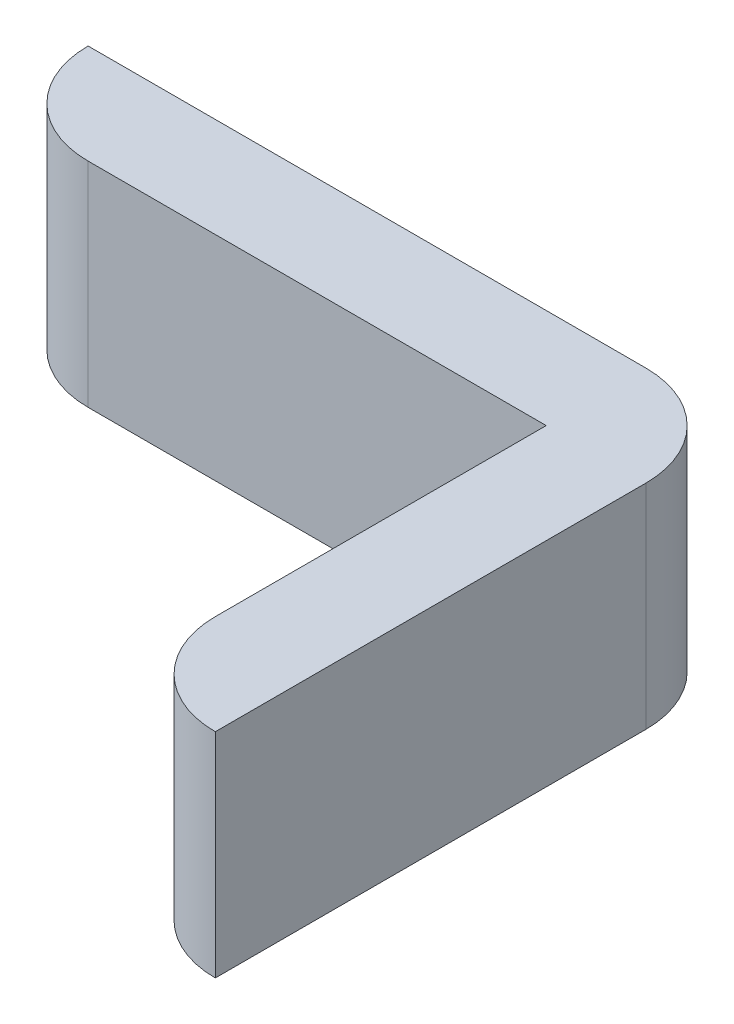
ISO-10303-21;
HEADER;
FILE_DESCRIPTION(('STEP AP214'),'2;1');
FILE_NAME('part.step','',(''),(''),'','','');
FILE_SCHEMA(('AUTOMOTIVE_DESIGN { 1 0 10303 214 1 1 1 1 }'));
ENDSEC;
DATA;
#1=APPLICATION_CONTEXT('core data for automotive mechanical design processes');
#2=APPLICATION_PROTOCOL_DEFINITION('international standard','automotive_design',2000,#1);
#3=PRODUCT_CONTEXT('',#1,'mechanical');
#4=PRODUCT('Part','Part','',(#3));
#5=PRODUCT_RELATED_PRODUCT_CATEGORY('part','',(#4));
#6=PRODUCT_DEFINITION_FORMATION('','',#4);
#7=PRODUCT_DEFINITION_CONTEXT('part definition',#1,'design');
#8=PRODUCT_DEFINITION('design','',#6,#7);
#9=PRODUCT_DEFINITION_SHAPE('','',#8);
#10=(LENGTH_UNIT() NAMED_UNIT(*) SI_UNIT(.MILLI.,.METRE.));
#11=(NAMED_UNIT(*) PLANE_ANGLE_UNIT() SI_UNIT($,.RADIAN.));
#12=(NAMED_UNIT(*) SI_UNIT($,.STERADIAN.) SOLID_ANGLE_UNIT());
#13=UNCERTAINTY_MEASURE_WITH_UNIT(LENGTH_MEASURE(1.E-05),#10,'distance_accuracy_value','');
#14=(GEOMETRIC_REPRESENTATION_CONTEXT(3) GLOBAL_UNCERTAINTY_ASSIGNED_CONTEXT((#13)) GLOBAL_UNIT_ASSIGNED_CONTEXT((#10,
#11,#12)) REPRESENTATION_CONTEXT('',''));
#15=CARTESIAN_POINT('',(0.,0.,0.));
#16=DIRECTION('',(0.,0.,1.));
#17=DIRECTION('',(1.,0.,0.));
#18=AXIS2_PLACEMENT_3D('',#15,#16,#17);
#19=CARTESIAN_POINT('',(4.1275,-2.1725,1.33));
#20=DIRECTION('',(-1.,0.,0.));
#21=DIRECTION('',(0.,0.,1.));
#22=AXIS2_PLACEMENT_3D('',#19,#20,#21);
#23=PLANE('',#22);
#24=DIRECTION('',(0.,0.,-1.));
#25=VECTOR('',#24,1.);
#26=CARTESIAN_POINT('',(4.1275,-2.1725,0.));
#27=LINE('',#26,#25);
#28=CARTESIAN_POINT('',(4.1275,-2.1725,0.25));
#29=VERTEX_POINT('',#28);
#30=CARTESIAN_POINT('',(4.1275,-2.1725,1.33));
#31=VERTEX_POINT('',#30);
#32=EDGE_CURVE('E129',#29,#31,#27,.F.);
#33=ORIENTED_EDGE('',*,*,#32,.F.);
#34=DIRECTION('',(0.,-1.,0.));
#35=VECTOR('',#34,1.);
#36=CARTESIAN_POINT('',(4.1275,-2.1725,0.25));
#37=LINE('',#36,#35);
#38=CARTESIAN_POINT('',(4.1275,-1.6375,0.25));
#39=VERTEX_POINT('',#38);
#40=EDGE_CURVE('E82',#39,#29,#37,.T.);
#41=ORIENTED_EDGE('',*,*,#40,.F.);
#42=DIRECTION('',(0.,0.,-1.));
#43=VECTOR('',#42,1.);
#44=CARTESIAN_POINT('',(4.1275,-1.6375,0.));
#45=LINE('',#44,#43);
#46=CARTESIAN_POINT('',(4.1275,-1.6375,1.33));
#47=VERTEX_POINT('',#46);
#48=EDGE_CURVE('E77',#39,#47,#45,.F.);
#49=ORIENTED_EDGE('',*,*,#48,.T.);
#50=DIRECTION('',(0.,-1.,0.));
#51=VECTOR('',#50,1.);
#52=CARTESIAN_POINT('',(4.1275,-2.1725,1.33));
#53=LINE('',#52,#51);
#54=EDGE_CURVE('E123',#31,#47,#53,.F.);
#55=ORIENTED_EDGE('',*,*,#54,.F.);
#56=EDGE_LOOP('',(#33,#41,#49,#55));
#57=FACE_BOUND('',#56,.T.);
#58=ADVANCED_FACE('F17',(#57),#23,.F.);
#59=CARTESIAN_POINT('',(4.1275,-2.1725,1.08));
#60=DIRECTION('',(0.,-1.,0.));
#61=DIRECTION('',(0.,0.,-1.));
#62=AXIS2_PLACEMENT_3D('',#59,#60,#61);
#63=CYLINDRICAL_SURFACE('',#62,0.25);
#64=CARTESIAN_POINT('',(4.1275,-1.6375,1.08));
#65=DIRECTION('',(0.,-1.,0.));
#66=DIRECTION('',(0.,0.,-1.));
#67=AXIS2_PLACEMENT_3D('',#64,#65,#66);
#68=CIRCLE('',#67,0.25);
#69=CARTESIAN_POINT('',(3.8775,-1.6375,1.08));
#70=VERTEX_POINT('',#69);
#71=EDGE_CURVE('E107',#47,#70,#68,.T.);
#72=ORIENTED_EDGE('',*,*,#71,.T.);
#73=DIRECTION('',(0.,1.,0.));
#74=VECTOR('',#73,1.);
#75=CARTESIAN_POINT('',(3.8775,-2.1725,1.08));
#76=LINE('',#75,#74);
#77=CARTESIAN_POINT('',(3.8775,-2.1725,1.08));
#78=VERTEX_POINT('',#77);
#79=EDGE_CURVE('E118',#70,#78,#76,.F.);
#80=ORIENTED_EDGE('',*,*,#79,.T.);
#81=CARTESIAN_POINT('',(4.1275,-2.1725,1.08));
#82=DIRECTION('',(0.,-1.,0.));
#83=DIRECTION('',(0.,0.,-1.));
#84=AXIS2_PLACEMENT_3D('',#81,#82,#83);
#85=CIRCLE('',#84,0.25);
#86=EDGE_CURVE('E126',#31,#78,#85,.T.);
#87=ORIENTED_EDGE('',*,*,#86,.F.);
#88=ORIENTED_EDGE('',*,*,#54,.T.);
#89=EDGE_LOOP('',(#72,#80,#87,#88));
#90=FACE_BOUND('',#89,.T.);
#91=ADVANCED_FACE('F133',(#90),#63,.T.);
#92=CARTESIAN_POINT('',(3.8775,-2.1725,0.25));
#93=DIRECTION('',(1.,0.,0.));
#94=DIRECTION('',(0.,0.,-1.));
#95=AXIS2_PLACEMENT_3D('',#92,#93,#94);
#96=PLANE('',#95);
#97=ORIENTED_EDGE('',*,*,#79,.F.);
#98=DIRECTION('',(0.,0.,-1.));
#99=VECTOR('',#98,1.);
#100=CARTESIAN_POINT('',(3.8775,-1.6375,0.));
#101=LINE('',#100,#99);
#102=CARTESIAN_POINT('',(3.8775,-1.6375,0.25));
#103=VERTEX_POINT('',#102);
#104=EDGE_CURVE('E102',#70,#103,#101,.T.);
#105=ORIENTED_EDGE('',*,*,#104,.T.);
#106=DIRECTION('',(0.,1.,0.));
#107=VECTOR('',#106,1.);
#108=CARTESIAN_POINT('',(3.8775,-2.1725,0.25));
#109=LINE('',#108,#107);
#110=CARTESIAN_POINT('',(3.8775,-2.1725,0.25));
#111=VERTEX_POINT('',#110);
#112=EDGE_CURVE('E115',#103,#111,#109,.F.);
#113=ORIENTED_EDGE('',*,*,#112,.T.);
#114=DIRECTION('',(0.,0.,-1.));
#115=VECTOR('',#114,1.);
#116=CARTESIAN_POINT('',(3.8775,-2.1725,0.));
#117=LINE('',#116,#115);
#118=EDGE_CURVE('E128',#78,#111,#117,.T.);
#119=ORIENTED_EDGE('',*,*,#118,.F.);
#120=EDGE_LOOP('',(#97,#105,#113,#119));
#121=FACE_BOUND('',#120,.T.);
#122=ADVANCED_FACE('F158',(#121),#96,.F.);
#123=CARTESIAN_POINT('',(2.7285,-2.1725,0.25));
#124=DIRECTION('',(0.,0.,-1.));
#125=DIRECTION('',(-1.,0.,0.));
#126=AXIS2_PLACEMENT_3D('',#123,#124,#125);
#127=PLANE('',#126);
#128=ORIENTED_EDGE('',*,*,#112,.F.);
#129=DIRECTION('',(1.,0.,0.));
#130=VECTOR('',#129,1.);
#131=CARTESIAN_POINT('',(2.4785,-1.6375,0.25));
#132=LINE('',#131,#130);
#133=CARTESIAN_POINT('',(2.7285,-1.6375,0.25));
#134=VERTEX_POINT('',#133);
#135=EDGE_CURVE('E98',#103,#134,#132,.F.);
#136=ORIENTED_EDGE('',*,*,#135,.T.);
#137=DIRECTION('',(0.,-1.,0.));
#138=VECTOR('',#137,1.);
#139=CARTESIAN_POINT('',(2.7285,-2.1725,0.25));
#140=LINE('',#139,#138);
#141=CARTESIAN_POINT('',(2.7285,-2.1725,0.25));
#142=VERTEX_POINT('',#141);
#143=EDGE_CURVE('E101',#142,#134,#140,.F.);
#144=ORIENTED_EDGE('',*,*,#143,.F.);
#145=DIRECTION('',(1.,0.,0.));
#146=VECTOR('',#145,1.);
#147=CARTESIAN_POINT('',(2.4785,-2.1725,0.25));
#148=LINE('',#147,#146);
#149=EDGE_CURVE('E94',#111,#142,#148,.F.);
#150=ORIENTED_EDGE('',*,*,#149,.F.);
#151=EDGE_LOOP('',(#128,#136,#144,#150));
#152=FACE_BOUND('',#151,.T.);
#153=ADVANCED_FACE('F156',(#152),#127,.F.);
#154=CARTESIAN_POINT('',(3.8775,-2.1725,0.25));
#155=DIRECTION('',(0.,-1.,0.));
#156=DIRECTION('',(0.,0.,-1.));
#157=AXIS2_PLACEMENT_3D('',#154,#155,#156);
#158=CYLINDRICAL_SURFACE('',#157,0.25);
#159=CARTESIAN_POINT('',(3.8775,-1.6375,0.25));
#160=DIRECTION('',(0.,-1.,0.));
#161=DIRECTION('',(0.,0.,-1.));
#162=AXIS2_PLACEMENT_3D('',#159,#160,#161);
#163=CIRCLE('',#162,0.25);
#164=CARTESIAN_POINT('',(3.8775,-1.6375,0.));
#165=VERTEX_POINT('',#164);
#166=EDGE_CURVE('E20',#165,#39,#163,.T.);
#167=ORIENTED_EDGE('',*,*,#166,.T.);
#168=ORIENTED_EDGE('',*,*,#40,.T.);
#169=CARTESIAN_POINT('',(3.8775,-2.1725,0.25));
#170=DIRECTION('',(0.,-1.,0.));
#171=DIRECTION('',(0.,0.,-1.));
#172=AXIS2_PLACEMENT_3D('',#169,#170,#171);
#173=CIRCLE('',#172,0.25);
#174=CARTESIAN_POINT('',(3.8775,-2.1725,0.));
#175=VERTEX_POINT('',#174);
#176=EDGE_CURVE('E92',#175,#29,#173,.T.);
#177=ORIENTED_EDGE('',*,*,#176,.F.);
#178=DIRECTION('',(0.,1.,0.));
#179=VECTOR('',#178,1.);
#180=CARTESIAN_POINT('',(3.8775,-2.1725,0.));
#181=LINE('',#180,#179);
#182=EDGE_CURVE('E86',#175,#165,#181,.T.);
#183=ORIENTED_EDGE('',*,*,#182,.T.);
#184=EDGE_LOOP('',(#167,#168,#177,#183));
#185=FACE_BOUND('',#184,.T.);
#186=ADVANCED_FACE('F90',(#185),#158,.T.);
#187=CARTESIAN_POINT('',(2.4785,-1.6375,0.));
#188=DIRECTION('',(0.,-1.,0.));
#189=DIRECTION('',(0.,0.,-1.));
#190=AXIS2_PLACEMENT_3D('',#187,#188,#189);
#191=PLANE('',#190);
#192=ORIENTED_EDGE('',*,*,#135,.F.);
#193=ORIENTED_EDGE('',*,*,#104,.F.);
#194=ORIENTED_EDGE('',*,*,#71,.F.);
#195=ORIENTED_EDGE('',*,*,#48,.F.);
#196=ORIENTED_EDGE('',*,*,#166,.F.);
#197=DIRECTION('',(1.,0.,0.));
#198=VECTOR('',#197,1.);
#199=CARTESIAN_POINT('',(3.8775,-1.6375,0.));
#200=LINE('',#199,#198);
#201=CARTESIAN_POINT('',(2.4785,-1.6375,0.));
#202=VERTEX_POINT('',#201);
#203=EDGE_CURVE('E74',#165,#202,#200,.F.);
#204=ORIENTED_EDGE('',*,*,#203,.T.);
#205=CARTESIAN_POINT('',(2.7285,-1.6375,0.));
#206=DIRECTION('',(0.,-1.,0.));
#207=DIRECTION('',(0.,0.,-1.));
#208=AXIS2_PLACEMENT_3D('',#205,#206,#207);
#209=CIRCLE('',#208,0.25);
#210=EDGE_CURVE('E114',#134,#202,#209,.T.);
#211=ORIENTED_EDGE('',*,*,#210,.F.);
#212=EDGE_LOOP('',(#192,#193,#194,#195,#196,#204,#211));
#213=FACE_BOUND('',#212,.T.);
#214=ADVANCED_FACE('F72',(#213),#191,.F.);
#215=CARTESIAN_POINT('',(2.7285,-2.1725,0.));
#216=DIRECTION('',(0.,-1.,0.));
#217=DIRECTION('',(0.,0.,-1.));
#218=AXIS2_PLACEMENT_3D('',#215,#216,#217);
#219=CYLINDRICAL_SURFACE('',#218,0.25);
#220=ORIENTED_EDGE('',*,*,#210,.T.);
#221=DIRECTION('',(0.,1.,0.));
#222=VECTOR('',#221,1.);
#223=CARTESIAN_POINT('',(2.4785,-2.1725,0.));
#224=LINE('',#223,#222);
#225=CARTESIAN_POINT('',(2.4785,-2.1725,0.));
#226=VERTEX_POINT('',#225);
#227=EDGE_CURVE('E26',#202,#226,#224,.F.);
#228=ORIENTED_EDGE('',*,*,#227,.T.);
#229=CARTESIAN_POINT('',(2.7285,-2.1725,0.));
#230=DIRECTION('',(0.,-1.,0.));
#231=DIRECTION('',(0.,0.,-1.));
#232=AXIS2_PLACEMENT_3D('',#229,#230,#231);
#233=CIRCLE('',#232,0.25);
#234=EDGE_CURVE('E34',#142,#226,#233,.T.);
#235=ORIENTED_EDGE('',*,*,#234,.F.);
#236=ORIENTED_EDGE('',*,*,#143,.T.);
#237=EDGE_LOOP('',(#220,#228,#235,#236));
#238=FACE_BOUND('',#237,.T.);
#239=ADVANCED_FACE('F141',(#238),#219,.T.);
#240=CARTESIAN_POINT('',(2.4785,-2.1725,0.));
#241=DIRECTION('',(0.,-1.,0.));
#242=DIRECTION('',(0.,0.,-1.));
#243=AXIS2_PLACEMENT_3D('',#240,#241,#242);
#244=PLANE('',#243);
#245=ORIENTED_EDGE('',*,*,#149,.T.);
#246=ORIENTED_EDGE('',*,*,#234,.T.);
#247=DIRECTION('',(1.,0.,0.));
#248=VECTOR('',#247,1.);
#249=CARTESIAN_POINT('',(3.8775,-2.1725,0.));
#250=LINE('',#249,#248);
#251=EDGE_CURVE('E11',#226,#175,#250,.T.);
#252=ORIENTED_EDGE('',*,*,#251,.T.);
#253=ORIENTED_EDGE('',*,*,#176,.T.);
#254=ORIENTED_EDGE('',*,*,#32,.T.);
#255=ORIENTED_EDGE('',*,*,#86,.T.);
#256=ORIENTED_EDGE('',*,*,#118,.T.);
#257=EDGE_LOOP('',(#245,#246,#252,#253,#254,#255,#256));
#258=FACE_BOUND('',#257,.T.);
#259=ADVANCED_FACE('F139',(#258),#244,.T.);
#260=CARTESIAN_POINT('',(3.8775,-2.1725,0.));
#261=DIRECTION('',(0.,0.,1.));
#262=DIRECTION('',(1.,0.,0.));
#263=AXIS2_PLACEMENT_3D('',#260,#261,#262);
#264=PLANE('',#263);
#265=ORIENTED_EDGE('',*,*,#227,.F.);
#266=ORIENTED_EDGE('',*,*,#203,.F.);
#267=ORIENTED_EDGE('',*,*,#182,.F.);
#268=ORIENTED_EDGE('',*,*,#251,.F.);
#269=EDGE_LOOP('',(#265,#266,#267,#268));
#270=FACE_BOUND('',#269,.T.);
#271=ADVANCED_FACE('F85',(#270),#264,.F.);
#272=CLOSED_SHELL('',(#58,#91,#122,#153,#186,#214,#239,#259,#271));
#273=MANIFOLD_SOLID_BREP('B1',#272);
#274=ADVANCED_BREP_SHAPE_REPRESENTATION('',(#18,#273),#14);
#275=SHAPE_DEFINITION_REPRESENTATION(#9,#274);
ENDSEC;
END-ISO-10303-21;
